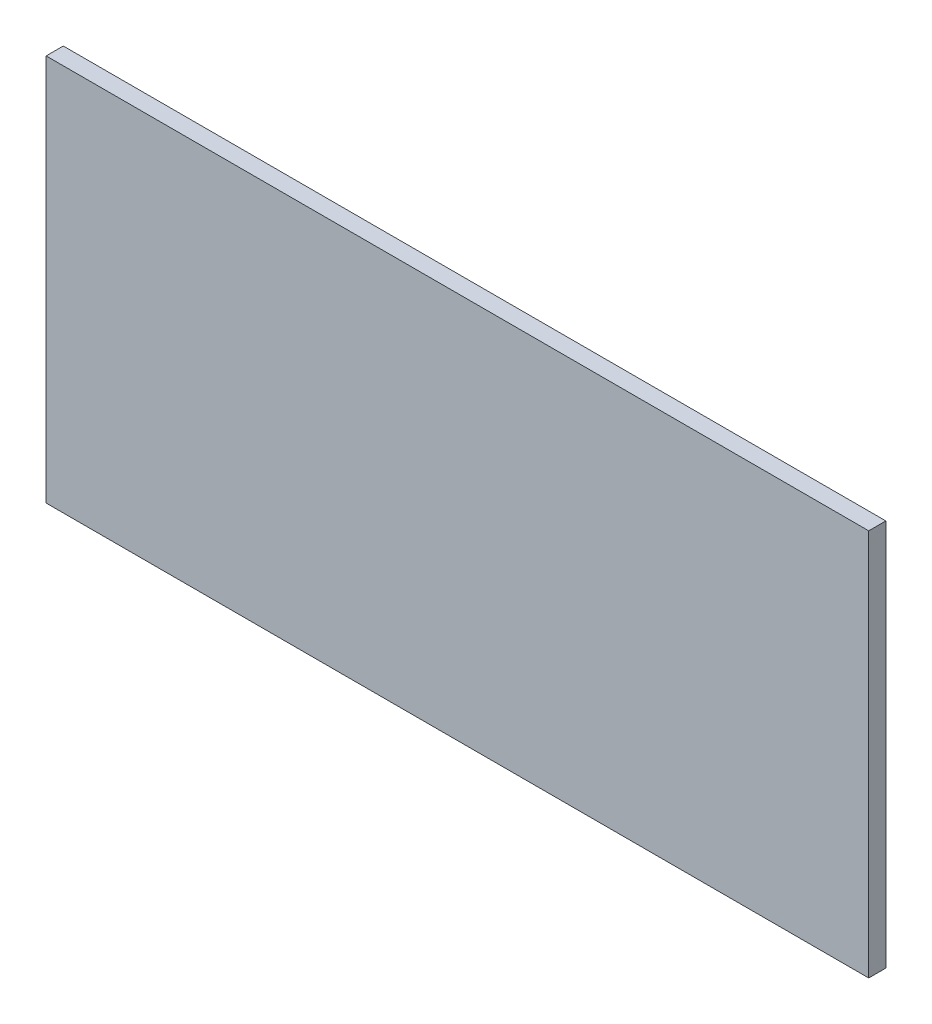
ISO-10303-21;
HEADER;
FILE_DESCRIPTION(('STEP AP214'),'2;1');
FILE_NAME('part.step','',(''),(''),'','','');
FILE_SCHEMA(('AUTOMOTIVE_DESIGN { 1 0 10303 214 1 1 1 1 }'));
ENDSEC;
DATA;
#1=APPLICATION_CONTEXT('core data for automotive mechanical design processes');
#2=APPLICATION_PROTOCOL_DEFINITION('international standard','automotive_design',2000,#1);
#3=PRODUCT_CONTEXT('',#1,'mechanical');
#4=PRODUCT('Part','Part','',(#3));
#5=PRODUCT_RELATED_PRODUCT_CATEGORY('part','',(#4));
#6=PRODUCT_DEFINITION_FORMATION('','',#4);
#7=PRODUCT_DEFINITION_CONTEXT('part definition',#1,'design');
#8=PRODUCT_DEFINITION('design','',#6,#7);
#9=PRODUCT_DEFINITION_SHAPE('','',#8);
#10=(LENGTH_UNIT() NAMED_UNIT(*) SI_UNIT(.MILLI.,.METRE.));
#11=(NAMED_UNIT(*) PLANE_ANGLE_UNIT() SI_UNIT($,.RADIAN.));
#12=(NAMED_UNIT(*) SI_UNIT($,.STERADIAN.) SOLID_ANGLE_UNIT());
#13=UNCERTAINTY_MEASURE_WITH_UNIT(LENGTH_MEASURE(1.E-05),#10,'distance_accuracy_value','');
#14=(GEOMETRIC_REPRESENTATION_CONTEXT(3) GLOBAL_UNCERTAINTY_ASSIGNED_CONTEXT((#13)) GLOBAL_UNIT_ASSIGNED_CONTEXT((#10,
#11,#12)) REPRESENTATION_CONTEXT('',''));
#15=CARTESIAN_POINT('',(0.,0.,0.));
#16=DIRECTION('',(0.,0.,1.));
#17=DIRECTION('',(1.,0.,0.));
#18=AXIS2_PLACEMENT_3D('',#15,#16,#17);
#19=CARTESIAN_POINT('',(0.,574.,0.));
#20=DIRECTION('',(1.,0.,0.));
#21=DIRECTION('',(0.,0.,-1.));
#22=AXIS2_PLACEMENT_3D('',#19,#20,#21);
#23=PLANE('',#22);
#24=DIRECTION('',(0.,0.,1.));
#25=VECTOR('',#24,1.);
#26=CARTESIAN_POINT('',(0.,0.,0.));
#27=LINE('',#26,#25);
#28=CARTESIAN_POINT('',(0.,0.,-25.4));
#29=VERTEX_POINT('',#28);
#30=CARTESIAN_POINT('',(0.,0.,0.));
#31=VERTEX_POINT('',#30);
#32=EDGE_CURVE('E96',#29,#31,#27,.T.);
#33=ORIENTED_EDGE('',*,*,#32,.T.);
#34=DIRECTION('',(0.,-1.,0.));
#35=VECTOR('',#34,1.);
#36=CARTESIAN_POINT('',(0.,574.,0.));
#37=LINE('',#36,#35);
#38=CARTESIAN_POINT('',(0.,574.,0.));
#39=VERTEX_POINT('',#38);
#40=EDGE_CURVE('E11',#39,#31,#37,.T.);
#41=ORIENTED_EDGE('',*,*,#40,.F.);
#42=DIRECTION('',(0.,0.,1.));
#43=VECTOR('',#42,1.);
#44=CARTESIAN_POINT('',(0.,574.,0.));
#45=LINE('',#44,#43);
#46=CARTESIAN_POINT('',(0.,574.,-25.4));
#47=VERTEX_POINT('',#46);
#48=EDGE_CURVE('E84',#47,#39,#45,.T.);
#49=ORIENTED_EDGE('',*,*,#48,.F.);
#50=DIRECTION('',(0.,-1.,0.));
#51=VECTOR('',#50,1.);
#52=CARTESIAN_POINT('',(0.,574.,-25.4));
#53=LINE('',#52,#51);
#54=EDGE_CURVE('E92',#47,#29,#53,.T.);
#55=ORIENTED_EDGE('',*,*,#54,.T.);
#56=EDGE_LOOP('',(#33,#41,#49,#55));
#57=FACE_BOUND('',#56,.T.);
#58=ADVANCED_FACE('F33',(#57),#23,.F.);
#59=CARTESIAN_POINT('',(0.,574.,0.));
#60=DIRECTION('',(0.,0.,-1.));
#61=DIRECTION('',(-1.,0.,0.));
#62=AXIS2_PLACEMENT_3D('',#59,#60,#61);
#63=PLANE('',#62);
#64=DIRECTION('',(1.,0.,0.));
#65=VECTOR('',#64,1.);
#66=CARTESIAN_POINT('',(0.,0.,0.));
#67=LINE('',#66,#65);
#68=CARTESIAN_POINT('',(1219.2,0.,0.));
#69=VERTEX_POINT('',#68);
#70=EDGE_CURVE('E88',#31,#69,#67,.T.);
#71=ORIENTED_EDGE('',*,*,#70,.T.);
#72=DIRECTION('',(0.,-1.,0.));
#73=VECTOR('',#72,1.);
#74=CARTESIAN_POINT('',(1219.2,574.,0.));
#75=LINE('',#74,#73);
#76=CARTESIAN_POINT('',(1219.2,574.,0.));
#77=VERTEX_POINT('',#76);
#78=EDGE_CURVE('E41',#77,#69,#75,.T.);
#79=ORIENTED_EDGE('',*,*,#78,.F.);
#80=DIRECTION('',(1.,0.,0.));
#81=VECTOR('',#80,1.);
#82=CARTESIAN_POINT('',(0.,574.,0.));
#83=LINE('',#82,#81);
#84=EDGE_CURVE('E79',#39,#77,#83,.T.);
#85=ORIENTED_EDGE('',*,*,#84,.F.);
#86=ORIENTED_EDGE('',*,*,#40,.T.);
#87=EDGE_LOOP('',(#71,#79,#85,#86));
#88=FACE_BOUND('',#87,.T.);
#89=ADVANCED_FACE('F87',(#88),#63,.F.);
#90=CARTESIAN_POINT('',(1219.2,574.,0.));
#91=DIRECTION('',(-1.,0.,0.));
#92=DIRECTION('',(0.,0.,1.));
#93=AXIS2_PLACEMENT_3D('',#90,#91,#92);
#94=PLANE('',#93);
#95=DIRECTION('',(0.,0.,-1.));
#96=VECTOR('',#95,1.);
#97=CARTESIAN_POINT('',(1219.2,0.,0.));
#98=LINE('',#97,#96);
#99=CARTESIAN_POINT('',(1219.2,0.,-25.4));
#100=VERTEX_POINT('',#99);
#101=EDGE_CURVE('E66',#69,#100,#98,.T.);
#102=ORIENTED_EDGE('',*,*,#101,.T.);
#103=DIRECTION('',(0.,-1.,0.));
#104=VECTOR('',#103,1.);
#105=CARTESIAN_POINT('',(1219.2,574.,-25.4));
#106=LINE('',#105,#104);
#107=CARTESIAN_POINT('',(1219.2,574.,-25.4));
#108=VERTEX_POINT('',#107);
#109=EDGE_CURVE('E89',#108,#100,#106,.T.);
#110=ORIENTED_EDGE('',*,*,#109,.F.);
#111=DIRECTION('',(0.,0.,-1.));
#112=VECTOR('',#111,1.);
#113=CARTESIAN_POINT('',(1219.2,574.,0.));
#114=LINE('',#113,#112);
#115=EDGE_CURVE('E82',#77,#108,#114,.T.);
#116=ORIENTED_EDGE('',*,*,#115,.F.);
#117=ORIENTED_EDGE('',*,*,#78,.T.);
#118=EDGE_LOOP('',(#102,#110,#116,#117));
#119=FACE_BOUND('',#118,.T.);
#120=ADVANCED_FACE('F90',(#119),#94,.F.);
#121=CARTESIAN_POINT('',(0.,574.,-25.4));
#122=DIRECTION('',(0.,0.,1.));
#123=DIRECTION('',(1.,0.,0.));
#124=AXIS2_PLACEMENT_3D('',#121,#122,#123);
#125=PLANE('',#124);
#126=DIRECTION('',(-1.,0.,0.));
#127=VECTOR('',#126,1.);
#128=CARTESIAN_POINT('',(0.,0.,-25.4));
#129=LINE('',#128,#127);
#130=EDGE_CURVE('E72',#100,#29,#129,.T.);
#131=ORIENTED_EDGE('',*,*,#130,.T.);
#132=ORIENTED_EDGE('',*,*,#54,.F.);
#133=DIRECTION('',(-1.,0.,0.));
#134=VECTOR('',#133,1.);
#135=CARTESIAN_POINT('',(0.,574.,-25.4));
#136=LINE('',#135,#134);
#137=EDGE_CURVE('E49',#108,#47,#136,.T.);
#138=ORIENTED_EDGE('',*,*,#137,.F.);
#139=ORIENTED_EDGE('',*,*,#109,.T.);
#140=EDGE_LOOP('',(#131,#132,#138,#139));
#141=FACE_BOUND('',#140,.T.);
#142=ADVANCED_FACE('F103',(#141),#125,.F.);
#143=CARTESIAN_POINT('',(0.,574.,0.));
#144=DIRECTION('',(0.,-1.,0.));
#145=DIRECTION('',(0.,0.,-1.));
#146=AXIS2_PLACEMENT_3D('',#143,#144,#145);
#147=PLANE('',#146);
#148=ORIENTED_EDGE('',*,*,#48,.T.);
#149=ORIENTED_EDGE('',*,*,#84,.T.);
#150=ORIENTED_EDGE('',*,*,#115,.T.);
#151=ORIENTED_EDGE('',*,*,#137,.T.);
#152=EDGE_LOOP('',(#148,#149,#150,#151));
#153=FACE_BOUND('',#152,.T.);
#154=ADVANCED_FACE('F80',(#153),#147,.F.);
#155=CARTESIAN_POINT('',(0.,0.,0.));
#156=DIRECTION('',(0.,-1.,0.));
#157=DIRECTION('',(0.,0.,-1.));
#158=AXIS2_PLACEMENT_3D('',#155,#156,#157);
#159=PLANE('',#158);
#160=ORIENTED_EDGE('',*,*,#32,.F.);
#161=ORIENTED_EDGE('',*,*,#130,.F.);
#162=ORIENTED_EDGE('',*,*,#101,.F.);
#163=ORIENTED_EDGE('',*,*,#70,.F.);
#164=EDGE_LOOP('',(#160,#161,#162,#163));
#165=FACE_BOUND('',#164,.T.);
#166=ADVANCED_FACE('F106',(#165),#159,.T.);
#167=CLOSED_SHELL('',(#58,#89,#120,#142,#154,#166));
#168=MANIFOLD_SOLID_BREP('B2',#167);
#169=ADVANCED_BREP_SHAPE_REPRESENTATION('',(#18,#168),#14);
#170=SHAPE_DEFINITION_REPRESENTATION(#9,#169);
ENDSEC;
END-ISO-10303-21;
